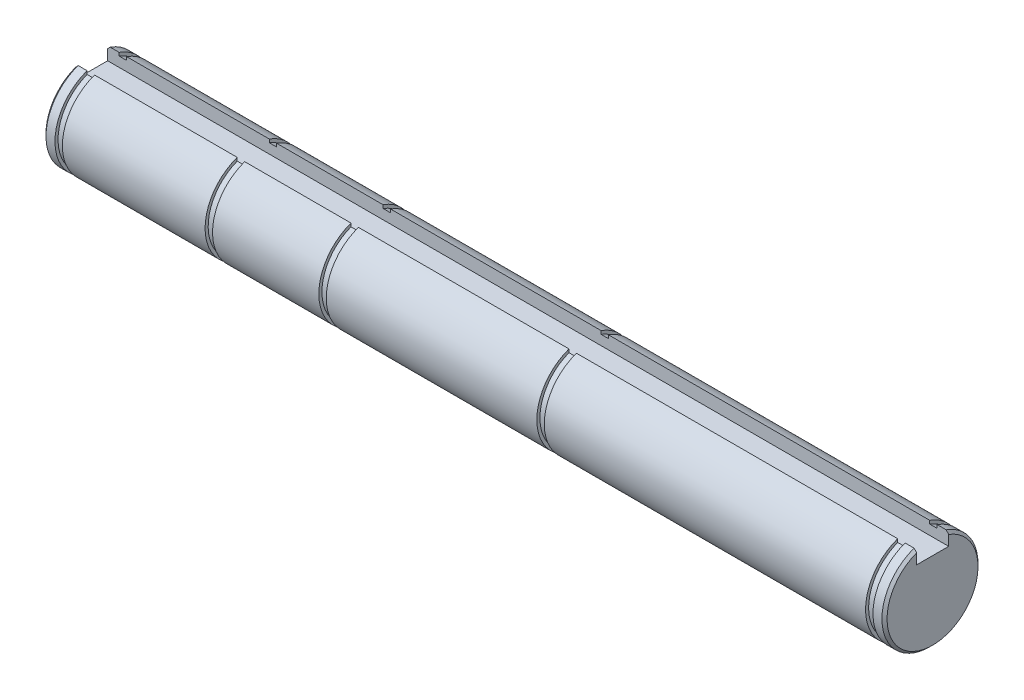
ISO-10303-21;
HEADER;
FILE_DESCRIPTION(('STEP AP214'),'2;1');
FILE_NAME('part.step','',(''),(''),'','','');
FILE_SCHEMA(('AUTOMOTIVE_DESIGN { 1 0 10303 214 1 1 1 1 }'));
ENDSEC;
DATA;
#1=APPLICATION_CONTEXT('core data for automotive mechanical design processes');
#2=APPLICATION_PROTOCOL_DEFINITION('international standard','automotive_design',2000,#1);
#3=PRODUCT_CONTEXT('',#1,'mechanical');
#4=PRODUCT('Part','Part','',(#3));
#5=PRODUCT_RELATED_PRODUCT_CATEGORY('part','',(#4));
#6=PRODUCT_DEFINITION_FORMATION('','',#4);
#7=PRODUCT_DEFINITION_CONTEXT('part definition',#1,'design');
#8=PRODUCT_DEFINITION('design','',#6,#7);
#9=PRODUCT_DEFINITION_SHAPE('','',#8);
#10=(LENGTH_UNIT() NAMED_UNIT(*) SI_UNIT(.MILLI.,.METRE.));
#11=(NAMED_UNIT(*) PLANE_ANGLE_UNIT() SI_UNIT($,.RADIAN.));
#12=(NAMED_UNIT(*) SI_UNIT($,.STERADIAN.) SOLID_ANGLE_UNIT());
#13=UNCERTAINTY_MEASURE_WITH_UNIT(LENGTH_MEASURE(1.E-05),#10,'distance_accuracy_value','');
#14=(GEOMETRIC_REPRESENTATION_CONTEXT(3) GLOBAL_UNCERTAINTY_ASSIGNED_CONTEXT((#13)) GLOBAL_UNIT_ASSIGNED_CONTEXT((#10,
#11,#12)) REPRESENTATION_CONTEXT('',''));
#15=CARTESIAN_POINT('',(0.,0.,0.));
#16=DIRECTION('',(0.,0.,1.));
#17=DIRECTION('',(1.,0.,0.));
#18=AXIS2_PLACEMENT_3D('',#15,#16,#17);
#19=CARTESIAN_POINT('',(659.149940305764,362.854954756465,0.));
#20=DIRECTION('',(1.,0.,0.));
#21=DIRECTION('',(0.,0.,-1.));
#22=AXIS2_PLACEMENT_3D('',#19,#20,#21);
#23=PLANE('',#22);
#24=DIRECTION('',(0.,1.,0.));
#25=VECTOR('',#24,1.);
#26=CARTESIAN_POINT('',(659.149940305764,362.854954756465,1.5748));
#27=LINE('',#26,#25);
#28=CARTESIAN_POINT('',(659.149940305764,362.415117847686,1.57480000000001));
#29=VERTEX_POINT('',#28);
#30=CARTESIAN_POINT('',(659.149940305764,362.739452759623,1.57480000000001));
#31=VERTEX_POINT('',#30);
#32=EDGE_CURVE('E185',#29,#31,#27,.T.);
#33=ORIENTED_EDGE('',*,*,#32,.T.);
#34=CARTESIAN_POINT('',(659.149940305764,358.244854756465,0.));
#35=DIRECTION('',(1.,0.,0.));
#36=DIRECTION('',(0.,0.,-1.));
#37=AXIS2_PLACEMENT_3D('',#34,#35,#36);
#38=CIRCLE('',#37,4.7625);
#39=CARTESIAN_POINT('',(659.149940305764,362.730472463091,-1.60020000000001));
#40=VERTEX_POINT('',#39);
#41=EDGE_CURVE('E20',#40,#31,#38,.F.);
#42=ORIENTED_EDGE('',*,*,#41,.F.);
#43=DIRECTION('',(0.,1.,0.));
#44=VECTOR('',#43,1.);
#45=CARTESIAN_POINT('',(659.149940305764,362.854954756465,-1.6002));
#46=LINE('',#45,#44);
#47=CARTESIAN_POINT('',(659.149940305764,362.405437558188,-1.60020000000001));
#48=VERTEX_POINT('',#47);
#49=EDGE_CURVE('E180',#40,#48,#46,.F.);
#50=ORIENTED_EDGE('',*,*,#49,.T.);
#51=CARTESIAN_POINT('',(659.149940305764,358.244854756465,0.));
#52=DIRECTION('',(1.,0.,0.));
#53=DIRECTION('',(0.,0.,-1.));
#54=AXIS2_PLACEMENT_3D('',#51,#52,#53);
#55=CIRCLE('',#54,4.45770000000003);
#56=EDGE_CURVE('E190',#29,#48,#55,.T.);
#57=ORIENTED_EDGE('',*,*,#56,.F.);
#58=EDGE_LOOP('',(#33,#42,#50,#57));
#59=FACE_BOUND('',#58,.T.);
#60=ADVANCED_FACE('F17',(#59),#23,.T.);
#61=CARTESIAN_POINT('',(658.578440305764,358.244854756465,0.));
#62=DIRECTION('',(1.,0.,0.));
#63=DIRECTION('',(0.,0.,-1.));
#64=AXIS2_PLACEMENT_3D('',#61,#62,#63);
#65=CYLINDRICAL_SURFACE('',#64,4.7625);
#66=DIRECTION('',(1.,0.,0.));
#67=VECTOR('',#66,1.);
#68=CARTESIAN_POINT('',(658.578440305764,362.739452759623,1.57480000000002));
#69=LINE('',#68,#67);
#70=CARTESIAN_POINT('',(658.260940306004,362.739452759528,1.57480000000001));
#71=VERTEX_POINT('',#70);
#72=EDGE_CURVE('E195',#31,#71,#69,.F.);
#73=ORIENTED_EDGE('',*,*,#72,.T.);
#74=CARTESIAN_POINT('',(658.260940305865,358.244854756465,0.));
#75=DIRECTION('',(1.,0.,0.));
#76=DIRECTION('',(0.,-1.,0.));
#77=AXIS2_PLACEMENT_3D('',#74,#75,#76);
#78=CIRCLE('',#77,4.76249999982842);
#79=CARTESIAN_POINT('',(658.26094030598,362.730472463,-1.60020000000001));
#80=VERTEX_POINT('',#79);
#81=EDGE_CURVE('E332',#80,#71,#78,.F.);
#82=ORIENTED_EDGE('',*,*,#81,.F.);
#83=DIRECTION('',(1.,0.,0.));
#84=VECTOR('',#83,1.);
#85=CARTESIAN_POINT('',(658.578440305764,362.730472463091,-1.60020000000002));
#86=LINE('',#85,#84);
#87=EDGE_CURVE('E192',#80,#40,#86,.T.);
#88=ORIENTED_EDGE('',*,*,#87,.T.);
#89=ORIENTED_EDGE('',*,*,#41,.T.);
#90=EDGE_LOOP('',(#73,#82,#88,#89));
#91=FACE_BOUND('',#90,.T.);
#92=ADVANCED_FACE('F205',(#91),#65,.T.);
#93=CARTESIAN_POINT('',(740.823640305764,358.244854756465,0.));
#94=DIRECTION('',(1.,0.,0.));
#95=DIRECTION('',(0.,0.,-1.));
#96=AXIS2_PLACEMENT_3D('',#93,#94,#95);
#97=CYLINDRICAL_SURFACE('',#96,4.7625);
#98=DIRECTION('',(1.,0.,0.));
#99=VECTOR('',#98,1.);
#100=CARTESIAN_POINT('',(740.823640305764,362.739452759623,1.57480000000002));
#101=LINE('',#100,#99);
#102=CARTESIAN_POINT('',(741.141140305558,362.739452759563,1.57480000000001));
#103=VERTEX_POINT('',#102);
#104=CARTESIAN_POINT('',(740.252140305764,362.739452759623,1.57480000000001));
#105=VERTEX_POINT('',#104);
#106=EDGE_CURVE('E519',#103,#105,#101,.F.);
#107=ORIENTED_EDGE('',*,*,#106,.T.);
#108=CARTESIAN_POINT('',(740.252140305764,358.244854756465,0.));
#109=DIRECTION('',(1.,0.,0.));
#110=DIRECTION('',(0.,0.,-1.));
#111=AXIS2_PLACEMENT_3D('',#108,#109,#110);
#112=CIRCLE('',#111,4.7625);
#113=CARTESIAN_POINT('',(740.252140305764,362.730472463091,-1.60020000000001));
#114=VERTEX_POINT('',#113);
#115=EDGE_CURVE('E283',#114,#105,#112,.F.);
#116=ORIENTED_EDGE('',*,*,#115,.F.);
#117=DIRECTION('',(1.,0.,0.));
#118=VECTOR('',#117,1.);
#119=CARTESIAN_POINT('',(740.823640305764,362.730472463091,-1.60020000000002));
#120=LINE('',#119,#118);
#121=CARTESIAN_POINT('',(741.141140305614,362.730472463031,-1.60020000000001));
#122=VERTEX_POINT('',#121);
#123=EDGE_CURVE('E203',#114,#122,#120,.T.);
#124=ORIENTED_EDGE('',*,*,#123,.T.);
#125=CARTESIAN_POINT('',(741.141140305615,358.244854756465,0.));
#126=DIRECTION('',(-1.,0.,0.));
#127=DIRECTION('',(0.,-1.,0.));
#128=AXIS2_PLACEMENT_3D('',#125,#126,#127);
#129=CIRCLE('',#128,4.76249999988526);
#130=EDGE_CURVE('E296',#103,#122,#129,.F.);
#131=ORIENTED_EDGE('',*,*,#130,.F.);
#132=EDGE_LOOP('',(#107,#116,#124,#131));
#133=FACE_BOUND('',#132,.T.);
#134=ADVANCED_FACE('F539',(#133),#97,.T.);
#135=CARTESIAN_POINT('',(685.680240305764,358.244854756465,0.));
#136=DIRECTION('',(1.,0.,0.));
#137=DIRECTION('',(0.,0.,-1.));
#138=AXIS2_PLACEMENT_3D('',#135,#136,#137);
#139=CYLINDRICAL_SURFACE('',#138,4.45770000000003);
#140=DIRECTION('',(1.,0.,0.));
#141=VECTOR('',#140,1.);
#142=CARTESIAN_POINT('',(685.680240305764,362.415117847686,1.57480000000002));
#143=LINE('',#142,#141);
#144=CARTESIAN_POINT('',(686.048540305764,362.415117847686,1.5748));
#145=VERTEX_POINT('',#144);
#146=CARTESIAN_POINT('',(685.311940305764,362.415117847686,1.57480000000001));
#147=VERTEX_POINT('',#146);
#148=EDGE_CURVE('E514',#145,#147,#143,.F.);
#149=ORIENTED_EDGE('',*,*,#148,.T.);
#150=CARTESIAN_POINT('',(685.311940305764,358.244854756465,0.));
#151=DIRECTION('',(1.,0.,0.));
#152=DIRECTION('',(0.,0.,-1.));
#153=AXIS2_PLACEMENT_3D('',#150,#151,#152);
#154=CIRCLE('',#153,4.45770000000003);
#155=CARTESIAN_POINT('',(685.311940305764,362.405437558188,-1.60020000000001));
#156=VERTEX_POINT('',#155);
#157=EDGE_CURVE('E274',#156,#147,#154,.F.);
#158=ORIENTED_EDGE('',*,*,#157,.F.);
#159=DIRECTION('',(1.,0.,0.));
#160=VECTOR('',#159,1.);
#161=CARTESIAN_POINT('',(685.680240305764,362.405437558188,-1.60020000000001));
#162=LINE('',#161,#160);
#163=CARTESIAN_POINT('',(686.048540305764,362.405437558188,-1.6002));
#164=VERTEX_POINT('',#163);
#165=EDGE_CURVE('E516',#156,#164,#162,.T.);
#166=ORIENTED_EDGE('',*,*,#165,.T.);
#167=CARTESIAN_POINT('',(686.048540305765,358.244854756465,0.));
#168=DIRECTION('',(1.,0.,0.));
#169=DIRECTION('',(0.,0.,-1.));
#170=AXIS2_PLACEMENT_3D('',#167,#168,#169);
#171=CIRCLE('',#170,4.45770000000003);
#172=EDGE_CURVE('E279',#145,#164,#171,.T.);
#173=ORIENTED_EDGE('',*,*,#172,.F.);
#174=EDGE_LOOP('',(#149,#158,#166,#173));
#175=FACE_BOUND('',#174,.T.);
#176=ADVANCED_FACE('F555',(#175),#139,.T.);
#177=CARTESIAN_POINT('',(674.402640305764,358.244854756465,0.));
#178=DIRECTION('',(1.,0.,0.));
#179=DIRECTION('',(0.,0.,-1.));
#180=AXIS2_PLACEMENT_3D('',#177,#178,#179);
#181=CYLINDRICAL_SURFACE('',#180,4.45770000000003);
#182=DIRECTION('',(1.,0.,0.));
#183=VECTOR('',#182,1.);
#184=CARTESIAN_POINT('',(674.402640305764,362.415117847686,1.57480000000002));
#185=LINE('',#184,#183);
#186=CARTESIAN_POINT('',(674.770940305764,362.415117847686,1.57480000000001));
#187=VERTEX_POINT('',#186);
#188=CARTESIAN_POINT('',(674.034340305764,362.415117847686,1.5748));
#189=VERTEX_POINT('',#188);
#190=EDGE_CURVE('E508',#187,#189,#185,.F.);
#191=ORIENTED_EDGE('',*,*,#190,.T.);
#192=CARTESIAN_POINT('',(674.034340305764,358.244854756465,0.));
#193=DIRECTION('',(1.,0.,0.));
#194=DIRECTION('',(0.,0.,-1.));
#195=AXIS2_PLACEMENT_3D('',#192,#193,#194);
#196=CIRCLE('',#195,4.45770000000003);
#197=CARTESIAN_POINT('',(674.034340305764,362.405437558188,-1.6002));
#198=VERTEX_POINT('',#197);
#199=EDGE_CURVE('E265',#198,#189,#196,.F.);
#200=ORIENTED_EDGE('',*,*,#199,.F.);
#201=DIRECTION('',(1.,0.,0.));
#202=VECTOR('',#201,1.);
#203=CARTESIAN_POINT('',(674.402640305764,362.405437558188,-1.60020000000001));
#204=LINE('',#203,#202);
#205=CARTESIAN_POINT('',(674.770940305764,362.405437558188,-1.60020000000001));
#206=VERTEX_POINT('',#205);
#207=EDGE_CURVE('E511',#198,#206,#204,.T.);
#208=ORIENTED_EDGE('',*,*,#207,.T.);
#209=CARTESIAN_POINT('',(674.770940305764,358.244854756465,0.));
#210=DIRECTION('',(1.,0.,0.));
#211=DIRECTION('',(0.,0.,-1.));
#212=AXIS2_PLACEMENT_3D('',#209,#210,#211);
#213=CIRCLE('',#212,4.45770000000003);
#214=EDGE_CURVE('E270',#187,#206,#213,.T.);
#215=ORIENTED_EDGE('',*,*,#214,.F.);
#216=EDGE_LOOP('',(#191,#200,#208,#215));
#217=FACE_BOUND('',#216,.T.);
#218=ADVANCED_FACE('F563',(#217),#181,.T.);
#219=CARTESIAN_POINT('',(659.518240305764,358.244854756465,0.));
#220=DIRECTION('',(1.,0.,0.));
#221=DIRECTION('',(0.,0.,-1.));
#222=AXIS2_PLACEMENT_3D('',#219,#220,#221);
#223=CYLINDRICAL_SURFACE('',#222,4.45770000000003);
#224=DIRECTION('',(1.,0.,0.));
#225=VECTOR('',#224,1.);
#226=CARTESIAN_POINT('',(659.518240305764,362.415117847686,1.57480000000002));
#227=LINE('',#226,#225);
#228=CARTESIAN_POINT('',(659.886540305764,362.415117847686,1.57480000000001));
#229=VERTEX_POINT('',#228);
#230=EDGE_CURVE('E507',#229,#29,#227,.F.);
#231=ORIENTED_EDGE('',*,*,#230,.T.);
#232=ORIENTED_EDGE('',*,*,#56,.T.);
#233=DIRECTION('',(1.,0.,0.));
#234=VECTOR('',#233,1.);
#235=CARTESIAN_POINT('',(659.518240305764,362.405437558188,-1.60020000000001));
#236=LINE('',#235,#234);
#237=CARTESIAN_POINT('',(659.886540305764,362.405437558188,-1.60020000000001));
#238=VERTEX_POINT('',#237);
#239=EDGE_CURVE('E504',#48,#238,#236,.T.);
#240=ORIENTED_EDGE('',*,*,#239,.T.);
#241=CARTESIAN_POINT('',(659.886540305764,358.244854756465,0.));
#242=DIRECTION('',(1.,0.,0.));
#243=DIRECTION('',(0.,0.,-1.));
#244=AXIS2_PLACEMENT_3D('',#241,#242,#243);
#245=CIRCLE('',#244,4.45770000000003);
#246=EDGE_CURVE('E261',#229,#238,#245,.T.);
#247=ORIENTED_EDGE('',*,*,#246,.F.);
#248=EDGE_LOOP('',(#231,#232,#240,#247));
#249=FACE_BOUND('',#248,.T.);
#250=ADVANCED_FACE('F319',(#249),#223,.T.);
#251=CARTESIAN_POINT('',(658.260940305809,358.244854756465,0.));
#252=DIRECTION('',(1.,0.,0.));
#253=DIRECTION('',(0.,0.,-1.));
#254=AXIS2_PLACEMENT_3D('',#251,#252,#253);
#255=CONICAL_SURFACE('',#254,4.76249999971473,0.78539816239038);
#256=CARTESIAN_POINT('',(658.260940305899,362.739452759446,1.57480000002548));
#257=CARTESIAN_POINT('',(658.218526596577,362.694515509578,1.57480000001274));
#258=CARTESIAN_POINT('',(658.17615307569,362.649540463597,1.57480000000425));
#259=CARTESIAN_POINT('',(658.091486408939,362.559514777445,1.57479999999575));
#260=CARTESIAN_POINT('',(658.049193263078,362.514464137272,1.57479999999575));
#261=CARTESIAN_POINT('',(658.006940305657,362.469375700982,1.5748));
#262=B_SPLINE_CURVE_WITH_KNOTS('',3,(#256,#257,#258,#259,#260,#261),.UNSPECIFIED.,.F.,.F.,(4,2,
4),(0.,0.185376455624091,0.370752919345591),.UNSPECIFIED.);
#263=CARTESIAN_POINT('',(658.006940305655,362.469375700981,1.5748));
#264=VERTEX_POINT('',#263);
#265=EDGE_CURVE('E199',#71,#264,#262,.T.);
#266=ORIENTED_EDGE('',*,*,#265,.T.);
#267=CARTESIAN_POINT('',(658.006940305654,358.244854756465,0.));
#268=DIRECTION('',(1.,0.,0.));
#269=DIRECTION('',(0.,0.,-1.));
#270=AXIS2_PLACEMENT_3D('',#267,#268,#269);
#271=CIRCLE('',#270,4.5085000000718);
#272=CARTESIAN_POINT('',(658.006940305655,362.45982002449,-1.6002));
#273=VERTEX_POINT('',#272);
#274=EDGE_CURVE('E256',#273,#264,#271,.F.);
#275=ORIENTED_EDGE('',*,*,#274,.F.);
#276=CARTESIAN_POINT('',(658.006940305669,362.45982002448,-1.60019999997872));
#277=CARTESIAN_POINT('',(658.049190128664,362.505007138446,-1.60019999998936));
#278=CARTESIAN_POINT('',(658.091481707348,362.550155065827,-1.60019999999645));
#279=CARTESIAN_POINT('',(658.176148374104,362.640372545301,-1.60020000000355));
#280=CARTESIAN_POINT('',(658.218523462173,362.685442097398,-1.60020000000355));
#281=CARTESIAN_POINT('',(658.260940305926,362.730472462913,-1.6002));
#282=B_SPLINE_CURVE_WITH_KNOTS('',3,(#276,#277,#278,#279,#280,#281),.UNSPECIFIED.,.F.,.F.,(4,2,
4),(0.,0.185586143797029,0.371172278880074),.UNSPECIFIED.);
#283=EDGE_CURVE('E327',#273,#80,#282,.T.);
#284=ORIENTED_EDGE('',*,*,#283,.T.);
#285=ORIENTED_EDGE('',*,*,#81,.T.);
#286=EDGE_LOOP('',(#266,#275,#284,#285));
#287=FACE_BOUND('',#286,.T.);
#288=ADVANCED_FACE('F312',(#287),#255,.T.);
#289=CARTESIAN_POINT('',(741.141140305672,358.244854756465,0.));
#290=DIRECTION('',(-1.,0.,0.));
#291=DIRECTION('',(0.,0.,1.));
#292=AXIS2_PLACEMENT_3D('',#289,#290,#291);
#293=CONICAL_SURFACE('',#292,4.76249999982842,0.785398162614173);
#294=CARTESIAN_POINT('',(741.395140305854,362.46937570095,1.5748));
#295=CARTESIAN_POINT('',(741.352887348438,362.514464137259,1.5748));
#296=CARTESIAN_POINT('',(741.31059420258,362.55951477745,1.5748));
#297=CARTESIAN_POINT('',(741.225927535829,362.649540463632,1.5748));
#298=CARTESIAN_POINT('',(741.18355401494,362.694515509625,1.5748));
#299=CARTESIAN_POINT('',(741.141140305612,362.739452759505,1.5748));
#300=B_SPLINE_CURVE_WITH_KNOTS('',3,(#294,#295,#296,#297,#298,#299),.UNSPECIFIED.,.F.,.F.,(4,2,
4),(0.,0.185376463754304,0.370752919411268),.UNSPECIFIED.);
#301=CARTESIAN_POINT('',(741.395140305869,362.469375700935,1.5748));
#302=VERTEX_POINT('',#301);
#303=EDGE_CURVE('E288',#302,#103,#300,.T.);
#304=ORIENTED_EDGE('',*,*,#303,.T.);
#305=ORIENTED_EDGE('',*,*,#130,.T.);
#306=CARTESIAN_POINT('',(741.141140305621,362.73047246298,-1.60020000001483));
#307=CARTESIAN_POINT('',(741.183557149363,362.685442097444,-1.60020000000741));
#308=CARTESIAN_POINT('',(741.225932237424,362.640372545329,-1.60020000000247));
#309=CARTESIAN_POINT('',(741.310598904173,362.550155065826,-1.60019999999753));
#310=CARTESIAN_POINT('',(741.352890482856,362.505007138433,-1.60019999999753));
#311=CARTESIAN_POINT('',(741.395140305854,362.459820024459,-1.6002));
#312=B_SPLINE_CURVE_WITH_KNOTS('',3,(#306,#307,#308,#309,#310,#311),.UNSPECIFIED.,.F.,.F.,(4,2,
4),(0.,0.18558613510714,0.371172278928194),.UNSPECIFIED.);
#313=CARTESIAN_POINT('',(741.395140305824,362.459820024491,-1.6002));
#314=VERTEX_POINT('',#313);
#315=EDGE_CURVE('E297',#122,#314,#312,.T.);
#316=ORIENTED_EDGE('',*,*,#315,.T.);
#317=CARTESIAN_POINT('',(741.395140305883,358.244854756465,0.));
#318=DIRECTION('',(-1.,0.,0.));
#319=DIRECTION('',(0.,0.,1.));
#320=AXIS2_PLACEMENT_3D('',#317,#318,#319);
#321=CIRCLE('',#320,4.50850000001496);
#322=EDGE_CURVE('E251',#302,#314,#321,.F.);
#323=ORIENTED_EDGE('',*,*,#322,.F.);
#324=EDGE_LOOP('',(#304,#305,#316,#323));
#325=FACE_BOUND('',#324,.T.);
#326=ADVANCED_FACE('F306',(#325),#293,.T.);
#327=CARTESIAN_POINT('',(740.252140305764,362.854954756465,0.));
#328=DIRECTION('',(-1.,0.,0.));
#329=DIRECTION('',(0.,0.,1.));
#330=AXIS2_PLACEMENT_3D('',#327,#328,#329);
#331=PLANE('',#330);
#332=DIRECTION('',(0.,1.,0.));
#333=VECTOR('',#332,1.);
#334=CARTESIAN_POINT('',(740.252140305764,362.854954756465,1.5748));
#335=LINE('',#334,#333);
#336=CARTESIAN_POINT('',(740.252140305764,362.415117847686,1.57480000000001));
#337=VERTEX_POINT('',#336);
#338=EDGE_CURVE('E286',#105,#337,#335,.F.);
#339=ORIENTED_EDGE('',*,*,#338,.T.);
#340=CARTESIAN_POINT('',(740.252140305764,358.244854756465,0.));
#341=DIRECTION('',(1.,0.,0.));
#342=DIRECTION('',(0.,0.,-1.));
#343=AXIS2_PLACEMENT_3D('',#340,#341,#342);
#344=CIRCLE('',#343,4.45770000000003);
#345=CARTESIAN_POINT('',(740.252140305764,362.405437558188,-1.6002));
#346=VERTEX_POINT('',#345);
#347=EDGE_CURVE('E247',#346,#337,#344,.F.);
#348=ORIENTED_EDGE('',*,*,#347,.F.);
#349=DIRECTION('',(0.,1.,0.));
#350=VECTOR('',#349,1.);
#351=CARTESIAN_POINT('',(740.252140305764,362.854954756465,-1.6002));
#352=LINE('',#351,#350);
#353=EDGE_CURVE('E287',#346,#114,#352,.T.);
#354=ORIENTED_EDGE('',*,*,#353,.T.);
#355=ORIENTED_EDGE('',*,*,#115,.T.);
#356=EDGE_LOOP('',(#339,#348,#354,#355));
#357=FACE_BOUND('',#356,.T.);
#358=ADVANCED_FACE('F311',(#357),#331,.T.);
#359=CARTESIAN_POINT('',(686.048540305764,362.854954756465,0.));
#360=DIRECTION('',(-1.,0.,0.));
#361=DIRECTION('',(0.,0.,1.));
#362=AXIS2_PLACEMENT_3D('',#359,#360,#361);
#363=PLANE('',#362);
#364=DIRECTION('',(0.,1.,0.));
#365=VECTOR('',#364,1.);
#366=CARTESIAN_POINT('',(686.048540305764,362.854954756465,1.5748));
#367=LINE('',#366,#365);
#368=CARTESIAN_POINT('',(686.048540305764,362.739452759623,1.5748));
#369=VERTEX_POINT('',#368);
#370=EDGE_CURVE('E282',#369,#145,#367,.F.);
#371=ORIENTED_EDGE('',*,*,#370,.T.);
#372=ORIENTED_EDGE('',*,*,#172,.T.);
#373=DIRECTION('',(0.,1.,0.));
#374=VECTOR('',#373,1.);
#375=CARTESIAN_POINT('',(686.048540305764,362.854954756465,-1.6002));
#376=LINE('',#375,#374);
#377=CARTESIAN_POINT('',(686.048540305764,362.730472463091,-1.6002));
#378=VERTEX_POINT('',#377);
#379=EDGE_CURVE('E479',#164,#378,#376,.T.);
#380=ORIENTED_EDGE('',*,*,#379,.T.);
#381=CARTESIAN_POINT('',(686.048540305765,358.244854756465,0.));
#382=DIRECTION('',(1.,0.,0.));
#383=DIRECTION('',(0.,0.,-1.));
#384=AXIS2_PLACEMENT_3D('',#381,#382,#383);
#385=CIRCLE('',#384,4.7625);
#386=EDGE_CURVE('E240',#369,#378,#385,.T.);
#387=ORIENTED_EDGE('',*,*,#386,.F.);
#388=EDGE_LOOP('',(#371,#372,#380,#387));
#389=FACE_BOUND('',#388,.T.);
#390=ADVANCED_FACE('F389',(#389),#363,.T.);
#391=CARTESIAN_POINT('',(685.311940305764,362.854954756465,0.));
#392=DIRECTION('',(1.,0.,0.));
#393=DIRECTION('',(0.,0.,-1.));
#394=AXIS2_PLACEMENT_3D('',#391,#392,#393);
#395=PLANE('',#394);
#396=DIRECTION('',(0.,1.,0.));
#397=VECTOR('',#396,1.);
#398=CARTESIAN_POINT('',(685.311940305764,362.854954756465,1.5748));
#399=LINE('',#398,#397);
#400=CARTESIAN_POINT('',(685.311940305764,362.739452759623,1.5748));
#401=VERTEX_POINT('',#400);
#402=EDGE_CURVE('E277',#147,#401,#399,.T.);
#403=ORIENTED_EDGE('',*,*,#402,.T.);
#404=CARTESIAN_POINT('',(685.311940305764,358.244854756465,0.));
#405=DIRECTION('',(1.,0.,0.));
#406=DIRECTION('',(0.,0.,-1.));
#407=AXIS2_PLACEMENT_3D('',#404,#405,#406);
#408=CIRCLE('',#407,4.7625);
#409=CARTESIAN_POINT('',(685.311940305764,362.730472463091,-1.6002));
#410=VERTEX_POINT('',#409);
#411=EDGE_CURVE('E237',#410,#401,#408,.F.);
#412=ORIENTED_EDGE('',*,*,#411,.F.);
#413=DIRECTION('',(0.,1.,0.));
#414=VECTOR('',#413,1.);
#415=CARTESIAN_POINT('',(685.311940305764,362.854954756465,-1.6002));
#416=LINE('',#415,#414);
#417=EDGE_CURVE('E278',#410,#156,#416,.F.);
#418=ORIENTED_EDGE('',*,*,#417,.T.);
#419=ORIENTED_EDGE('',*,*,#157,.T.);
#420=EDGE_LOOP('',(#403,#412,#418,#419));
#421=FACE_BOUND('',#420,.T.);
#422=ADVANCED_FACE('F386',(#421),#395,.T.);
#423=CARTESIAN_POINT('',(674.770940305764,362.854954756465,0.));
#424=DIRECTION('',(-1.,0.,0.));
#425=DIRECTION('',(0.,0.,1.));
#426=AXIS2_PLACEMENT_3D('',#423,#424,#425);
#427=PLANE('',#426);
#428=DIRECTION('',(0.,1.,0.));
#429=VECTOR('',#428,1.);
#430=CARTESIAN_POINT('',(674.770940305764,362.854954756465,1.5748));
#431=LINE('',#430,#429);
#432=CARTESIAN_POINT('',(674.770940305764,362.739452759623,1.5748));
#433=VERTEX_POINT('',#432);
#434=EDGE_CURVE('E273',#433,#187,#431,.F.);
#435=ORIENTED_EDGE('',*,*,#434,.T.);
#436=ORIENTED_EDGE('',*,*,#214,.T.);
#437=DIRECTION('',(0.,1.,0.));
#438=VECTOR('',#437,1.);
#439=CARTESIAN_POINT('',(674.770940305764,362.854954756465,-1.6002));
#440=LINE('',#439,#438);
#441=CARTESIAN_POINT('',(674.770940305764,362.730472463091,-1.6002));
#442=VERTEX_POINT('',#441);
#443=EDGE_CURVE('E469',#206,#442,#440,.T.);
#444=ORIENTED_EDGE('',*,*,#443,.T.);
#445=CARTESIAN_POINT('',(674.770940305764,358.244854756465,0.));
#446=DIRECTION('',(1.,0.,0.));
#447=DIRECTION('',(0.,0.,-1.));
#448=AXIS2_PLACEMENT_3D('',#445,#446,#447);
#449=CIRCLE('',#448,4.7625);
#450=EDGE_CURVE('E234',#433,#442,#449,.T.);
#451=ORIENTED_EDGE('',*,*,#450,.F.);
#452=EDGE_LOOP('',(#435,#436,#444,#451));
#453=FACE_BOUND('',#452,.T.);
#454=ADVANCED_FACE('F382',(#453),#427,.T.);
#455=CARTESIAN_POINT('',(674.034340305764,362.854954756465,0.));
#456=DIRECTION('',(1.,0.,0.));
#457=DIRECTION('',(0.,0.,-1.));
#458=AXIS2_PLACEMENT_3D('',#455,#456,#457);
#459=PLANE('',#458);
#460=DIRECTION('',(0.,1.,0.));
#461=VECTOR('',#460,1.);
#462=CARTESIAN_POINT('',(674.034340305764,362.854954756465,1.5748));
#463=LINE('',#462,#461);
#464=CARTESIAN_POINT('',(674.034340305764,362.739452759623,1.5748));
#465=VERTEX_POINT('',#464);
#466=EDGE_CURVE('E268',#189,#465,#463,.T.);
#467=ORIENTED_EDGE('',*,*,#466,.T.);
#468=CARTESIAN_POINT('',(674.034340305764,358.244854756465,0.));
#469=DIRECTION('',(1.,0.,0.));
#470=DIRECTION('',(0.,0.,-1.));
#471=AXIS2_PLACEMENT_3D('',#468,#469,#470);
#472=CIRCLE('',#471,4.7625);
#473=CARTESIAN_POINT('',(674.034340305764,362.730472463091,-1.6002));
#474=VERTEX_POINT('',#473);
#475=EDGE_CURVE('E231',#474,#465,#472,.F.);
#476=ORIENTED_EDGE('',*,*,#475,.F.);
#477=DIRECTION('',(0.,1.,0.));
#478=VECTOR('',#477,1.);
#479=CARTESIAN_POINT('',(674.034340305764,362.854954756465,-1.6002));
#480=LINE('',#479,#478);
#481=EDGE_CURVE('E269',#474,#198,#480,.F.);
#482=ORIENTED_EDGE('',*,*,#481,.T.);
#483=ORIENTED_EDGE('',*,*,#199,.T.);
#484=EDGE_LOOP('',(#467,#476,#482,#483));
#485=FACE_BOUND('',#484,.T.);
#486=ADVANCED_FACE('F378',(#485),#459,.T.);
#487=CARTESIAN_POINT('',(659.886540305764,362.854954756465,0.));
#488=DIRECTION('',(-1.,0.,0.));
#489=DIRECTION('',(0.,0.,1.));
#490=AXIS2_PLACEMENT_3D('',#487,#488,#489);
#491=PLANE('',#490);
#492=DIRECTION('',(0.,1.,0.));
#493=VECTOR('',#492,1.);
#494=CARTESIAN_POINT('',(659.886540305764,362.854954756465,1.5748));
#495=LINE('',#494,#493);
#496=CARTESIAN_POINT('',(659.886540305764,362.739452759623,1.5748));
#497=VERTEX_POINT('',#496);
#498=EDGE_CURVE('E264',#497,#229,#495,.F.);
#499=ORIENTED_EDGE('',*,*,#498,.T.);
#500=ORIENTED_EDGE('',*,*,#246,.T.);
#501=DIRECTION('',(0.,1.,0.));
#502=VECTOR('',#501,1.);
#503=CARTESIAN_POINT('',(659.886540305764,362.854954756465,-1.6002));
#504=LINE('',#503,#502);
#505=CARTESIAN_POINT('',(659.886540305764,362.730472463091,-1.6002));
#506=VERTEX_POINT('',#505);
#507=EDGE_CURVE('E453',#238,#506,#504,.T.);
#508=ORIENTED_EDGE('',*,*,#507,.T.);
#509=CARTESIAN_POINT('',(659.886540305764,358.244854756465,0.));
#510=DIRECTION('',(1.,0.,0.));
#511=DIRECTION('',(0.,0.,-1.));
#512=AXIS2_PLACEMENT_3D('',#509,#510,#511);
#513=CIRCLE('',#512,4.7625);
#514=EDGE_CURVE('E227',#497,#506,#513,.T.);
#515=ORIENTED_EDGE('',*,*,#514,.F.);
#516=EDGE_LOOP('',(#499,#500,#508,#515));
#517=FACE_BOUND('',#516,.T.);
#518=ADVANCED_FACE('F374',(#517),#491,.T.);
#519=CARTESIAN_POINT('',(658.006940305764,360.626104756465,0.));
#520=DIRECTION('',(-1.,0.,0.));
#521=DIRECTION('',(0.,0.,1.));
#522=AXIS2_PLACEMENT_3D('',#519,#520,#521);
#523=PLANE('',#522);
#524=DIRECTION('',(0.,1.,0.));
#525=VECTOR('',#524,1.);
#526=CARTESIAN_POINT('',(658.006940305764,360.626104756465,1.5748));
#527=LINE('',#526,#525);
#528=CARTESIAN_POINT('',(658.006940305764,361.432554756465,1.5748));
#529=VERTEX_POINT('',#528);
#530=EDGE_CURVE('E259',#264,#529,#527,.F.);
#531=ORIENTED_EDGE('',*,*,#530,.T.);
#532=DIRECTION('',(0.,0.,-1.));
#533=VECTOR('',#532,1.);
#534=CARTESIAN_POINT('',(658.006940305764,361.432554756465,-1.6002));
#535=LINE('',#534,#533);
#536=CARTESIAN_POINT('',(658.006940305764,361.432554756465,-1.6002));
#537=VERTEX_POINT('',#536);
#538=EDGE_CURVE('E230',#529,#537,#535,.T.);
#539=ORIENTED_EDGE('',*,*,#538,.T.);
#540=DIRECTION('',(0.,1.,0.));
#541=VECTOR('',#540,1.);
#542=CARTESIAN_POINT('',(658.006940305764,360.626104756465,-1.6002));
#543=LINE('',#542,#541);
#544=EDGE_CURVE('E260',#537,#273,#543,.T.);
#545=ORIENTED_EDGE('',*,*,#544,.T.);
#546=ORIENTED_EDGE('',*,*,#274,.T.);
#547=EDGE_LOOP('',(#531,#539,#545,#546));
#548=FACE_BOUND('',#547,.T.);
#549=ADVANCED_FACE('F370',(#548),#523,.T.);
#550=CARTESIAN_POINT('',(741.395140305764,360.626104756465,0.));
#551=DIRECTION('',(1.,0.,0.));
#552=DIRECTION('',(0.,0.,-1.));
#553=AXIS2_PLACEMENT_3D('',#550,#551,#552);
#554=PLANE('',#553);
#555=DIRECTION('',(0.,1.,0.));
#556=VECTOR('',#555,1.);
#557=CARTESIAN_POINT('',(741.395140305764,360.626104756465,1.5748));
#558=LINE('',#557,#556);
#559=CARTESIAN_POINT('',(741.395140305764,361.432554756465,1.5748));
#560=VERTEX_POINT('',#559);
#561=EDGE_CURVE('E255',#560,#302,#558,.T.);
#562=ORIENTED_EDGE('',*,*,#561,.T.);
#563=ORIENTED_EDGE('',*,*,#322,.T.);
#564=DIRECTION('',(0.,1.,0.));
#565=VECTOR('',#564,1.);
#566=CARTESIAN_POINT('',(741.395140305764,360.626104756465,-1.6002));
#567=LINE('',#566,#565);
#568=CARTESIAN_POINT('',(741.395140305764,361.432554756465,-1.6002));
#569=VERTEX_POINT('',#568);
#570=EDGE_CURVE('E436',#314,#569,#567,.F.);
#571=ORIENTED_EDGE('',*,*,#570,.T.);
#572=DIRECTION('',(0.,0.,-1.));
#573=VECTOR('',#572,1.);
#574=CARTESIAN_POINT('',(741.395140305764,361.432554756465,-1.6002));
#575=LINE('',#574,#573);
#576=EDGE_CURVE('E226',#569,#560,#575,.F.);
#577=ORIENTED_EDGE('',*,*,#576,.T.);
#578=EDGE_LOOP('',(#562,#563,#571,#577));
#579=FACE_BOUND('',#578,.T.);
#580=ADVANCED_FACE('F366',(#579),#554,.T.);
#581=CARTESIAN_POINT('',(706.927340305764,362.854954756465,0.));
#582=DIRECTION('',(1.,0.,0.));
#583=DIRECTION('',(0.,0.,-1.));
#584=AXIS2_PLACEMENT_3D('',#581,#582,#583);
#585=PLANE('',#584);
#586=DIRECTION('',(0.,1.,0.));
#587=VECTOR('',#586,1.);
#588=CARTESIAN_POINT('',(706.927340305764,362.854954756465,1.5748));
#589=LINE('',#588,#587);
#590=CARTESIAN_POINT('',(706.927340305764,362.415117847686,1.5748));
#591=VERTEX_POINT('',#590);
#592=CARTESIAN_POINT('',(706.927340305764,362.739452759623,1.5748));
#593=VERTEX_POINT('',#592);
#594=EDGE_CURVE('E250',#591,#593,#589,.T.);
#595=ORIENTED_EDGE('',*,*,#594,.T.);
#596=CARTESIAN_POINT('',(706.927340305764,358.244854756465,0.));
#597=DIRECTION('',(1.,0.,0.));
#598=DIRECTION('',(0.,0.,-1.));
#599=AXIS2_PLACEMENT_3D('',#596,#597,#598);
#600=CIRCLE('',#599,4.7625);
#601=CARTESIAN_POINT('',(706.927340305764,362.730472463091,-1.6002));
#602=VERTEX_POINT('',#601);
#603=EDGE_CURVE('E243',#602,#593,#600,.F.);
#604=ORIENTED_EDGE('',*,*,#603,.F.);
#605=DIRECTION('',(0.,1.,0.));
#606=VECTOR('',#605,1.);
#607=CARTESIAN_POINT('',(706.927340305764,362.854954756465,-1.6002));
#608=LINE('',#607,#606);
#609=CARTESIAN_POINT('',(706.927340305764,362.405437558188,-1.6002));
#610=VERTEX_POINT('',#609);
#611=EDGE_CURVE('E254',#602,#610,#608,.F.);
#612=ORIENTED_EDGE('',*,*,#611,.T.);
#613=CARTESIAN_POINT('',(706.927340305764,358.244854756465,0.));
#614=DIRECTION('',(1.,0.,0.));
#615=DIRECTION('',(0.,0.,-1.));
#616=AXIS2_PLACEMENT_3D('',#613,#614,#615);
#617=CIRCLE('',#616,4.45770000000003);
#618=EDGE_CURVE('E222',#591,#610,#617,.T.);
#619=ORIENTED_EDGE('',*,*,#618,.F.);
#620=EDGE_LOOP('',(#595,#604,#612,#619));
#621=FACE_BOUND('',#620,.T.);
#622=ADVANCED_FACE('F362',(#621),#585,.T.);
#623=CARTESIAN_POINT('',(739.883840305764,358.244854756465,0.));
#624=DIRECTION('',(1.,0.,0.));
#625=DIRECTION('',(0.,0.,-1.));
#626=AXIS2_PLACEMENT_3D('',#623,#624,#625);
#627=CYLINDRICAL_SURFACE('',#626,4.45770000000003);
#628=DIRECTION('',(1.,0.,0.));
#629=VECTOR('',#628,1.);
#630=CARTESIAN_POINT('',(739.883840305764,362.415117847686,1.57480000000002));
#631=LINE('',#630,#629);
#632=CARTESIAN_POINT('',(739.515540305764,362.415117847686,1.57480000000001));
#633=VERTEX_POINT('',#632);
#634=EDGE_CURVE('E246',#337,#633,#631,.F.);
#635=ORIENTED_EDGE('',*,*,#634,.T.);
#636=CARTESIAN_POINT('',(739.515540305764,358.244854756465,0.));
#637=DIRECTION('',(1.,0.,0.));
#638=DIRECTION('',(0.,0.,-1.));
#639=AXIS2_PLACEMENT_3D('',#636,#637,#638);
#640=CIRCLE('',#639,4.45770000000003);
#641=CARTESIAN_POINT('',(739.515540305764,362.405437558188,-1.6002));
#642=VERTEX_POINT('',#641);
#643=EDGE_CURVE('E217',#642,#633,#640,.F.);
#644=ORIENTED_EDGE('',*,*,#643,.F.);
#645=DIRECTION('',(-1.,0.,0.));
#646=VECTOR('',#645,1.);
#647=CARTESIAN_POINT('',(658.006940305764,362.405437558188,-1.6002));
#648=LINE('',#647,#646);
#649=EDGE_CURVE('E422',#642,#346,#648,.F.);
#650=ORIENTED_EDGE('',*,*,#649,.T.);
#651=ORIENTED_EDGE('',*,*,#347,.T.);
#652=EDGE_LOOP('',(#635,#644,#650,#651));
#653=FACE_BOUND('',#652,.T.);
#654=ADVANCED_FACE('F358',(#653),#627,.T.);
#655=CARTESIAN_POINT('',(696.487940305764,358.244854756465,0.));
#656=DIRECTION('',(1.,0.,0.));
#657=DIRECTION('',(0.,0.,-1.));
#658=AXIS2_PLACEMENT_3D('',#655,#656,#657);
#659=CYLINDRICAL_SURFACE('',#658,4.7625);
#660=DIRECTION('',(1.,0.,0.));
#661=VECTOR('',#660,1.);
#662=CARTESIAN_POINT('',(658.006940305764,362.739452759623,1.5748));
#663=LINE('',#662,#661);
#664=EDGE_CURVE('E425',#593,#369,#663,.F.);
#665=ORIENTED_EDGE('',*,*,#664,.T.);
#666=ORIENTED_EDGE('',*,*,#386,.T.);
#667=DIRECTION('',(-1.,0.,0.));
#668=VECTOR('',#667,1.);
#669=CARTESIAN_POINT('',(658.006940305764,362.730472463091,-1.6002));
#670=LINE('',#669,#668);
#671=EDGE_CURVE('E428',#378,#602,#670,.F.);
#672=ORIENTED_EDGE('',*,*,#671,.T.);
#673=ORIENTED_EDGE('',*,*,#603,.T.);
#674=EDGE_LOOP('',(#665,#666,#672,#673));
#675=FACE_BOUND('',#674,.T.);
#676=ADVANCED_FACE('F354',(#675),#659,.T.);
#677=CARTESIAN_POINT('',(680.041440305764,358.244854756465,0.));
#678=DIRECTION('',(1.,0.,0.));
#679=DIRECTION('',(0.,0.,-1.));
#680=AXIS2_PLACEMENT_3D('',#677,#678,#679);
#681=CYLINDRICAL_SURFACE('',#680,4.7625);
#682=DIRECTION('',(1.,0.,0.));
#683=VECTOR('',#682,1.);
#684=CARTESIAN_POINT('',(658.006940305764,362.739452759623,1.5748));
#685=LINE('',#684,#683);
#686=EDGE_CURVE('E459',#401,#433,#685,.F.);
#687=ORIENTED_EDGE('',*,*,#686,.T.);
#688=ORIENTED_EDGE('',*,*,#450,.T.);
#689=DIRECTION('',(-1.,0.,0.));
#690=VECTOR('',#689,1.);
#691=CARTESIAN_POINT('',(658.006940305764,362.730472463091,-1.6002));
#692=LINE('',#691,#690);
#693=EDGE_CURVE('E463',#442,#410,#692,.F.);
#694=ORIENTED_EDGE('',*,*,#693,.T.);
#695=ORIENTED_EDGE('',*,*,#411,.T.);
#696=EDGE_LOOP('',(#687,#688,#694,#695));
#697=FACE_BOUND('',#696,.T.);
#698=ADVANCED_FACE('F350',(#697),#681,.T.);
#699=CARTESIAN_POINT('',(666.960440305764,358.244854756465,0.));
#700=DIRECTION('',(1.,0.,0.));
#701=DIRECTION('',(0.,0.,-1.));
#702=AXIS2_PLACEMENT_3D('',#699,#700,#701);
#703=CYLINDRICAL_SURFACE('',#702,4.7625);
#704=DIRECTION('',(1.,0.,0.));
#705=VECTOR('',#704,1.);
#706=CARTESIAN_POINT('',(658.006940305764,362.739452759623,1.5748));
#707=LINE('',#706,#705);
#708=EDGE_CURVE('E455',#465,#497,#707,.F.);
#709=ORIENTED_EDGE('',*,*,#708,.T.);
#710=ORIENTED_EDGE('',*,*,#514,.T.);
#711=DIRECTION('',(-1.,0.,0.));
#712=VECTOR('',#711,1.);
#713=CARTESIAN_POINT('',(658.006940305764,362.730472463091,-1.6002));
#714=LINE('',#713,#712);
#715=EDGE_CURVE('E460',#506,#474,#714,.F.);
#716=ORIENTED_EDGE('',*,*,#715,.T.);
#717=ORIENTED_EDGE('',*,*,#475,.T.);
#718=EDGE_LOOP('',(#709,#710,#716,#717));
#719=FACE_BOUND('',#718,.T.);
#720=ADVANCED_FACE('F346',(#719),#703,.T.);
#721=CARTESIAN_POINT('',(658.006940305764,361.432554756465,-1.6002));
#722=DIRECTION('',(0.,-1.,0.));
#723=DIRECTION('',(0.,0.,-1.));
#724=AXIS2_PLACEMENT_3D('',#721,#722,#723);
#725=PLANE('',#724);
#726=DIRECTION('',(-1.,0.,0.));
#727=VECTOR('',#726,1.);
#728=CARTESIAN_POINT('',(658.006940305764,361.432554756465,-1.6002));
#729=LINE('',#728,#727);
#730=EDGE_CURVE('E225',#569,#537,#729,.T.);
#731=ORIENTED_EDGE('',*,*,#730,.T.);
#732=ORIENTED_EDGE('',*,*,#538,.F.);
#733=DIRECTION('',(1.,0.,0.));
#734=VECTOR('',#733,1.);
#735=CARTESIAN_POINT('',(658.006940305764,361.432554756465,1.5748));
#736=LINE('',#735,#734);
#737=EDGE_CURVE('E458',#529,#560,#736,.T.);
#738=ORIENTED_EDGE('',*,*,#737,.T.);
#739=ORIENTED_EDGE('',*,*,#576,.F.);
#740=EDGE_LOOP('',(#731,#732,#738,#739));
#741=FACE_BOUND('',#740,.T.);
#742=ADVANCED_FACE('F342',(#741),#725,.F.);
#743=CARTESIAN_POINT('',(707.295640305764,358.244854756465,0.));
#744=DIRECTION('',(1.,0.,0.));
#745=DIRECTION('',(0.,0.,-1.));
#746=AXIS2_PLACEMENT_3D('',#743,#744,#745);
#747=CYLINDRICAL_SURFACE('',#746,4.45770000000003);
#748=DIRECTION('',(1.,0.,0.));
#749=VECTOR('',#748,1.);
#750=CARTESIAN_POINT('',(658.006940305764,362.415117847686,1.5748));
#751=LINE('',#750,#749);
#752=CARTESIAN_POINT('',(707.663940305764,362.415117847686,1.5748));
#753=VERTEX_POINT('',#752);
#754=EDGE_CURVE('E419',#753,#591,#751,.F.);
#755=ORIENTED_EDGE('',*,*,#754,.T.);
#756=ORIENTED_EDGE('',*,*,#618,.T.);
#757=DIRECTION('',(-1.,0.,0.));
#758=VECTOR('',#757,1.);
#759=CARTESIAN_POINT('',(658.006940305764,362.405437558188,-1.6002));
#760=LINE('',#759,#758);
#761=CARTESIAN_POINT('',(707.663940305764,362.405437558188,-1.6002));
#762=VERTEX_POINT('',#761);
#763=EDGE_CURVE('E426',#610,#762,#760,.F.);
#764=ORIENTED_EDGE('',*,*,#763,.T.);
#765=CARTESIAN_POINT('',(707.663940305765,358.244854756465,0.));
#766=DIRECTION('',(1.,0.,0.));
#767=DIRECTION('',(0.,0.,-1.));
#768=AXIS2_PLACEMENT_3D('',#765,#766,#767);
#769=CIRCLE('',#768,4.45770000000003);
#770=EDGE_CURVE('E214',#753,#762,#769,.T.);
#771=ORIENTED_EDGE('',*,*,#770,.F.);
#772=EDGE_LOOP('',(#755,#756,#764,#771));
#773=FACE_BOUND('',#772,.T.);
#774=ADVANCED_FACE('F338',(#773),#747,.T.);
#775=CARTESIAN_POINT('',(658.006940305764,365.346444126746,-1.6002));
#776=DIRECTION('',(0.,0.,-1.));
#777=DIRECTION('',(-1.,0.,0.));
#778=AXIS2_PLACEMENT_3D('',#775,#776,#777);
#779=PLANE('',#778);
#780=ORIENTED_EDGE('',*,*,#315,.F.);
#781=ORIENTED_EDGE('',*,*,#123,.F.);
#782=ORIENTED_EDGE('',*,*,#353,.F.);
#783=ORIENTED_EDGE('',*,*,#649,.F.);
#784=DIRECTION('',(0.,1.,0.));
#785=VECTOR('',#784,1.);
#786=CARTESIAN_POINT('',(739.515540305764,362.854954756465,-1.6002));
#787=LINE('',#786,#785);
#788=CARTESIAN_POINT('',(739.515540305764,362.730472463091,-1.60020000000001));
#789=VERTEX_POINT('',#788);
#790=EDGE_CURVE('E221',#789,#642,#787,.F.);
#791=ORIENTED_EDGE('',*,*,#790,.F.);
#792=DIRECTION('',(1.,0.,0.));
#793=VECTOR('',#792,1.);
#794=CARTESIAN_POINT('',(723.589740305764,362.730472463091,-1.60020000000002));
#795=LINE('',#794,#793);
#796=CARTESIAN_POINT('',(707.663940305764,362.730472463091,-1.6002));
#797=VERTEX_POINT('',#796);
#798=EDGE_CURVE('E213',#797,#789,#795,.T.);
#799=ORIENTED_EDGE('',*,*,#798,.F.);
#800=DIRECTION('',(0.,1.,0.));
#801=VECTOR('',#800,1.);
#802=CARTESIAN_POINT('',(707.663940305764,362.854954756465,-1.6002));
#803=LINE('',#802,#801);
#804=EDGE_CURVE('E415',#762,#797,#803,.T.);
#805=ORIENTED_EDGE('',*,*,#804,.F.);
#806=ORIENTED_EDGE('',*,*,#763,.F.);
#807=ORIENTED_EDGE('',*,*,#611,.F.);
#808=ORIENTED_EDGE('',*,*,#671,.F.);
#809=ORIENTED_EDGE('',*,*,#379,.F.);
#810=ORIENTED_EDGE('',*,*,#165,.F.);
#811=ORIENTED_EDGE('',*,*,#417,.F.);
#812=ORIENTED_EDGE('',*,*,#693,.F.);
#813=ORIENTED_EDGE('',*,*,#443,.F.);
#814=ORIENTED_EDGE('',*,*,#207,.F.);
#815=ORIENTED_EDGE('',*,*,#481,.F.);
#816=ORIENTED_EDGE('',*,*,#715,.F.);
#817=ORIENTED_EDGE('',*,*,#507,.F.);
#818=ORIENTED_EDGE('',*,*,#239,.F.);
#819=ORIENTED_EDGE('',*,*,#49,.F.);
#820=ORIENTED_EDGE('',*,*,#87,.F.);
#821=ORIENTED_EDGE('',*,*,#283,.F.);
#822=ORIENTED_EDGE('',*,*,#544,.F.);
#823=ORIENTED_EDGE('',*,*,#730,.F.);
#824=ORIENTED_EDGE('',*,*,#570,.F.);
#825=EDGE_LOOP('',(#780,#781,#782,#783,#791,#799,#805,#806,#807,#808,#809,#810,#811,#812,#813,
#814,#815,#816,#817,#818,#819,#820,#821,#822,#823,#824));
#826=FACE_BOUND('',#825,.T.);
#827=ADVANCED_FACE('F333',(#826),#779,.F.);
#828=CARTESIAN_POINT('',(739.515540305764,362.854954756465,0.));
#829=DIRECTION('',(1.,0.,0.));
#830=DIRECTION('',(0.,0.,-1.));
#831=AXIS2_PLACEMENT_3D('',#828,#829,#830);
#832=PLANE('',#831);
#833=DIRECTION('',(0.,1.,0.));
#834=VECTOR('',#833,1.);
#835=CARTESIAN_POINT('',(739.515540305764,361.432554756465,1.5748));
#836=LINE('',#835,#834);
#837=CARTESIAN_POINT('',(739.515540305764,362.739452759623,1.57480000000001));
#838=VERTEX_POINT('',#837);
#839=EDGE_CURVE('E220',#633,#838,#836,.T.);
#840=ORIENTED_EDGE('',*,*,#839,.T.);
#841=CARTESIAN_POINT('',(739.515540305764,358.244854756465,0.));
#842=DIRECTION('',(1.,0.,0.));
#843=DIRECTION('',(0.,0.,-1.));
#844=AXIS2_PLACEMENT_3D('',#841,#842,#843);
#845=CIRCLE('',#844,4.7625);
#846=EDGE_CURVE('E210',#789,#838,#845,.F.);
#847=ORIENTED_EDGE('',*,*,#846,.F.);
#848=ORIENTED_EDGE('',*,*,#790,.T.);
#849=ORIENTED_EDGE('',*,*,#643,.T.);
#850=EDGE_LOOP('',(#840,#847,#848,#849));
#851=FACE_BOUND('',#850,.T.);
#852=ADVANCED_FACE('F337',(#851),#832,.T.);
#853=CARTESIAN_POINT('',(658.006940305764,361.432554756465,1.5748));
#854=DIRECTION('',(0.,0.,1.));
#855=DIRECTION('',(1.,0.,0.));
#856=AXIS2_PLACEMENT_3D('',#853,#854,#855);
#857=PLANE('',#856);
#858=ORIENTED_EDGE('',*,*,#737,.F.);
#859=ORIENTED_EDGE('',*,*,#530,.F.);
#860=ORIENTED_EDGE('',*,*,#265,.F.);
#861=ORIENTED_EDGE('',*,*,#72,.F.);
#862=ORIENTED_EDGE('',*,*,#32,.F.);
#863=ORIENTED_EDGE('',*,*,#230,.F.);
#864=ORIENTED_EDGE('',*,*,#498,.F.);
#865=ORIENTED_EDGE('',*,*,#708,.F.);
#866=ORIENTED_EDGE('',*,*,#466,.F.);
#867=ORIENTED_EDGE('',*,*,#190,.F.);
#868=ORIENTED_EDGE('',*,*,#434,.F.);
#869=ORIENTED_EDGE('',*,*,#686,.F.);
#870=ORIENTED_EDGE('',*,*,#402,.F.);
#871=ORIENTED_EDGE('',*,*,#148,.F.);
#872=ORIENTED_EDGE('',*,*,#370,.F.);
#873=ORIENTED_EDGE('',*,*,#664,.F.);
#874=ORIENTED_EDGE('',*,*,#594,.F.);
#875=ORIENTED_EDGE('',*,*,#754,.F.);
#876=DIRECTION('',(0.,1.,0.));
#877=VECTOR('',#876,1.);
#878=CARTESIAN_POINT('',(707.663940305764,362.854954756465,1.5748));
#879=LINE('',#878,#877);
#880=CARTESIAN_POINT('',(707.663940305764,362.739452759623,1.57480000000001));
#881=VERTEX_POINT('',#880);
#882=EDGE_CURVE('E35',#881,#753,#879,.F.);
#883=ORIENTED_EDGE('',*,*,#882,.F.);
#884=DIRECTION('',(1.,0.,0.));
#885=VECTOR('',#884,1.);
#886=CARTESIAN_POINT('',(723.589740305764,362.739452759623,1.57480000000002));
#887=LINE('',#886,#885);
#888=EDGE_CURVE('E26',#838,#881,#887,.F.);
#889=ORIENTED_EDGE('',*,*,#888,.F.);
#890=ORIENTED_EDGE('',*,*,#839,.F.);
#891=ORIENTED_EDGE('',*,*,#634,.F.);
#892=ORIENTED_EDGE('',*,*,#338,.F.);
#893=ORIENTED_EDGE('',*,*,#106,.F.);
#894=ORIENTED_EDGE('',*,*,#303,.F.);
#895=ORIENTED_EDGE('',*,*,#561,.F.);
#896=EDGE_LOOP('',(#858,#859,#860,#861,#862,#863,#864,#865,#866,#867,#868,#869,#870,#871,#872,
#873,#874,#875,#883,#889,#890,#891,#892,#893,#894,#895));
#897=FACE_BOUND('',#896,.T.);
#898=ADVANCED_FACE('F197',(#897),#857,.F.);
#899=CARTESIAN_POINT('',(707.663940305764,362.854954756465,0.));
#900=DIRECTION('',(-1.,0.,0.));
#901=DIRECTION('',(0.,0.,1.));
#902=AXIS2_PLACEMENT_3D('',#899,#900,#901);
#903=PLANE('',#902);
#904=ORIENTED_EDGE('',*,*,#882,.T.);
#905=ORIENTED_EDGE('',*,*,#770,.T.);
#906=ORIENTED_EDGE('',*,*,#804,.T.);
#907=CARTESIAN_POINT('',(707.663940305765,358.244854756465,0.));
#908=DIRECTION('',(1.,0.,0.));
#909=DIRECTION('',(0.,0.,-1.));
#910=AXIS2_PLACEMENT_3D('',#907,#908,#909);
#911=CIRCLE('',#910,4.7625);
#912=EDGE_CURVE('E11',#881,#797,#911,.T.);
#913=ORIENTED_EDGE('',*,*,#912,.F.);
#914=EDGE_LOOP('',(#904,#905,#906,#913));
#915=FACE_BOUND('',#914,.T.);
#916=ADVANCED_FACE('F401',(#915),#903,.T.);
#917=CARTESIAN_POINT('',(723.589740305764,358.244854756465,0.));
#918=DIRECTION('',(1.,0.,0.));
#919=DIRECTION('',(0.,0.,-1.));
#920=AXIS2_PLACEMENT_3D('',#917,#918,#919);
#921=CYLINDRICAL_SURFACE('',#920,4.7625);
#922=ORIENTED_EDGE('',*,*,#888,.T.);
#923=ORIENTED_EDGE('',*,*,#912,.T.);
#924=ORIENTED_EDGE('',*,*,#798,.T.);
#925=ORIENTED_EDGE('',*,*,#846,.T.);
#926=EDGE_LOOP('',(#922,#923,#924,#925));
#927=FACE_BOUND('',#926,.T.);
#928=ADVANCED_FACE('F399',(#927),#921,.T.);
#929=CLOSED_SHELL('',(#60,#92,#134,#176,#218,#250,#288,#326,#358,#390,#422,#454,#486,#518,#549,
#580,#622,#654,#676,#698,#720,#742,#774,#827,#852,#898,#916,#928));
#930=MANIFOLD_SOLID_BREP('B1',#929);
#931=ADVANCED_BREP_SHAPE_REPRESENTATION('',(#18,#930),#14);
#932=SHAPE_DEFINITION_REPRESENTATION(#9,#931);
ENDSEC;
END-ISO-10303-21;
